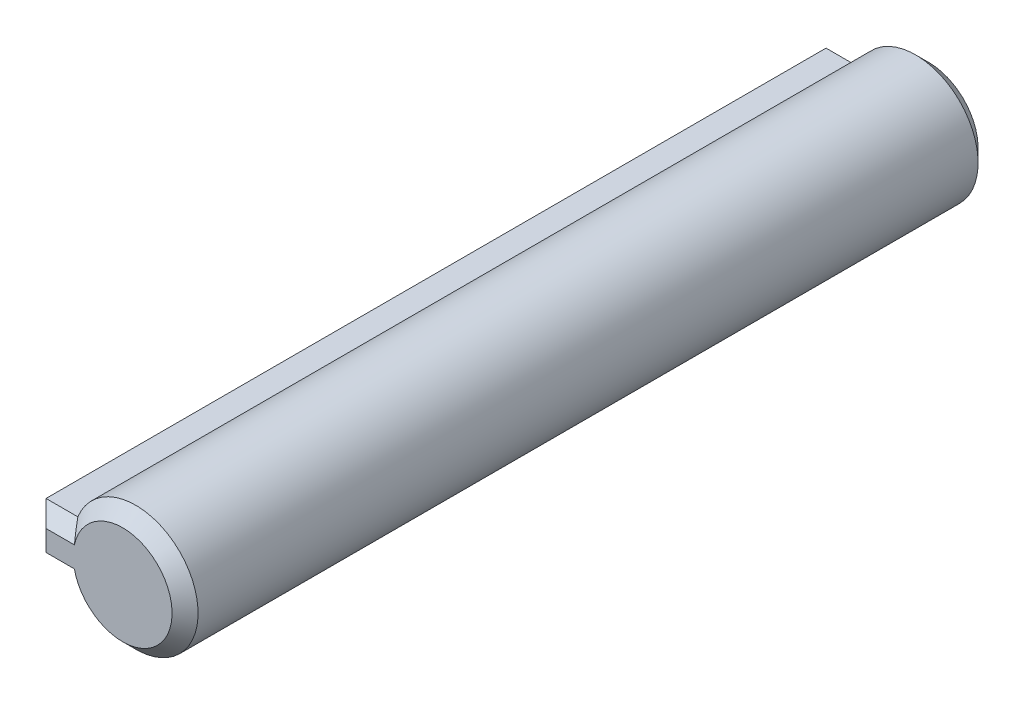
ISO-10303-21;
HEADER;
FILE_DESCRIPTION(('STEP AP214'),'2;1');
FILE_NAME('part.step','',(''),(''),'','','');
FILE_SCHEMA(('AUTOMOTIVE_DESIGN { 1 0 10303 214 1 1 1 1 }'));
ENDSEC;
DATA;
#1=APPLICATION_CONTEXT('core data for automotive mechanical design processes');
#2=APPLICATION_PROTOCOL_DEFINITION('international standard','automotive_design',2000,#1);
#3=PRODUCT_CONTEXT('',#1,'mechanical');
#4=PRODUCT('Part','Part','',(#3));
#5=PRODUCT_RELATED_PRODUCT_CATEGORY('part','',(#4));
#6=PRODUCT_DEFINITION_FORMATION('','',#4);
#7=PRODUCT_DEFINITION_CONTEXT('part definition',#1,'design');
#8=PRODUCT_DEFINITION('design','',#6,#7);
#9=PRODUCT_DEFINITION_SHAPE('','',#8);
#10=(LENGTH_UNIT() NAMED_UNIT(*) SI_UNIT(.MILLI.,.METRE.));
#11=(NAMED_UNIT(*) PLANE_ANGLE_UNIT() SI_UNIT($,.RADIAN.));
#12=(NAMED_UNIT(*) SI_UNIT($,.STERADIAN.) SOLID_ANGLE_UNIT());
#13=UNCERTAINTY_MEASURE_WITH_UNIT(LENGTH_MEASURE(1.E-05),#10,'distance_accuracy_value','');
#14=(GEOMETRIC_REPRESENTATION_CONTEXT(3) GLOBAL_UNCERTAINTY_ASSIGNED_CONTEXT((#13)) GLOBAL_UNIT_ASSIGNED_CONTEXT((#10,
#11,#12)) REPRESENTATION_CONTEXT('',''));
#15=CARTESIAN_POINT('',(0.,0.,0.));
#16=DIRECTION('',(0.,0.,1.));
#17=DIRECTION('',(1.,0.,0.));
#18=AXIS2_PLACEMENT_3D('',#15,#16,#17);
#19=CARTESIAN_POINT('',(-0.207098277141903,-1.1475,50.7625));
#20=DIRECTION('',(0.,1.,0.));
#21=DIRECTION('',(0.,0.,1.));
#22=AXIS2_PLACEMENT_3D('',#19,#20,#21);
#23=PLANE('',#22);
#24=DIRECTION('',(0.,0.,-1.));
#25=VECTOR('',#24,1.);
#26=CARTESIAN_POINT('',(-4.60429977375132,-1.1475,50.7625));
#27=LINE('',#26,#25);
#28=CARTESIAN_POINT('',(-4.60429977375132,-1.1475,50.125));
#29=VERTEX_POINT('',#28);
#30=CARTESIAN_POINT('',(-4.60429977375132,-1.1475,11.875));
#31=VERTEX_POINT('',#30);
#32=EDGE_CURVE('E120',#29,#31,#27,.T.);
#33=ORIENTED_EDGE('',*,*,#32,.T.);
#34=DIRECTION('',(1.,0.,0.));
#35=VECTOR('',#34,1.);
#36=CARTESIAN_POINT('',(-0.207098277141903,-1.1475,11.875));
#37=LINE('',#36,#35);
#38=CARTESIAN_POINT('',(-3.04379419845599,-1.1475,11.875));
#39=VERTEX_POINT('',#38);
#40=EDGE_CURVE('E128',#31,#39,#37,.T.);
#41=ORIENTED_EDGE('',*,*,#40,.T.);
#42=DIRECTION('',(0.,0.,-1.));
#43=VECTOR('',#42,1.);
#44=CARTESIAN_POINT('',(-3.04379419845599,-1.1475,50.7625));
#45=LINE('',#44,#43);
#46=CARTESIAN_POINT('',(-3.04379419845599,-1.1475,50.125));
#47=VERTEX_POINT('',#46);
#48=EDGE_CURVE('E122',#47,#39,#45,.T.);
#49=ORIENTED_EDGE('',*,*,#48,.F.);
#50=DIRECTION('',(-1.,0.,0.));
#51=VECTOR('',#50,1.);
#52=CARTESIAN_POINT('',(-4.60429977375132,-1.1475,50.125));
#53=LINE('',#52,#51);
#54=EDGE_CURVE('E117',#47,#29,#53,.T.);
#55=ORIENTED_EDGE('',*,*,#54,.T.);
#56=EDGE_LOOP('',(#33,#41,#49,#55));
#57=FACE_BOUND('',#56,.T.);
#58=ADVANCED_FACE('F48',(#57),#23,.F.);
#59=CARTESIAN_POINT('',(-0.207098277141903,0.,50.7625));
#60=DIRECTION('',(0.,0.,-1.));
#61=DIRECTION('',(-1.,0.,0.));
#62=AXIS2_PLACEMENT_3D('',#59,#60,#61);
#63=CYLINDRICAL_SURFACE('',#62,3.06);
#64=ORIENTED_EDGE('',*,*,#48,.T.);
#65=CARTESIAN_POINT('',(-0.207098277141903,0.,11.875));
#66=DIRECTION('',(0.,0.,1.));
#67=DIRECTION('',(1.,0.,0.));
#68=AXIS2_PLACEMENT_3D('',#65,#66,#67);
#69=CIRCLE('',#68,3.06);
#70=CARTESIAN_POINT('',(-3.04379419845599,1.1475,11.875));
#71=VERTEX_POINT('',#70);
#72=EDGE_CURVE('E12',#39,#71,#69,.T.);
#73=ORIENTED_EDGE('',*,*,#72,.T.);
#74=DIRECTION('',(0.,0.,-1.));
#75=VECTOR('',#74,1.);
#76=CARTESIAN_POINT('',(-3.04379419845599,1.1475,50.7625));
#77=LINE('',#76,#75);
#78=CARTESIAN_POINT('',(-3.04379419845599,1.1475,50.125));
#79=VERTEX_POINT('',#78);
#80=EDGE_CURVE('E162',#79,#71,#77,.T.);
#81=ORIENTED_EDGE('',*,*,#80,.F.);
#82=CARTESIAN_POINT('',(-0.207098277141903,0.,50.125));
#83=DIRECTION('',(0.,0.,1.));
#84=DIRECTION('',(1.,0.,0.));
#85=AXIS2_PLACEMENT_3D('',#82,#83,#84);
#86=CIRCLE('',#85,3.06);
#87=EDGE_CURVE('E129',#79,#47,#86,.F.);
#88=ORIENTED_EDGE('',*,*,#87,.T.);
#89=EDGE_LOOP('',(#64,#73,#81,#88));
#90=FACE_BOUND('',#89,.T.);
#91=ADVANCED_FACE('F244',(#90),#63,.T.);
#92=CARTESIAN_POINT('',(-0.207098277141903,1.1475,50.7625));
#93=DIRECTION('',(0.,1.,0.));
#94=DIRECTION('',(-1.,0.,0.));
#95=AXIS2_PLACEMENT_3D('',#92,#93,#94);
#96=PLANE('',#95);
#97=ORIENTED_EDGE('',*,*,#80,.T.);
#98=DIRECTION('',(-1.,0.,0.));
#99=VECTOR('',#98,1.);
#100=CARTESIAN_POINT('',(-4.60429977375132,1.1475,11.875));
#101=LINE('',#100,#99);
#102=CARTESIAN_POINT('',(-4.60429977375132,1.1475,11.875));
#103=VERTEX_POINT('',#102);
#104=EDGE_CURVE('E58',#71,#103,#101,.T.);
#105=ORIENTED_EDGE('',*,*,#104,.T.);
#106=DIRECTION('',(0.,0.,-1.));
#107=VECTOR('',#106,1.);
#108=CARTESIAN_POINT('',(-4.60429977375132,1.1475,50.7625));
#109=LINE('',#108,#107);
#110=CARTESIAN_POINT('',(-4.60429977375132,1.1475,50.125));
#111=VERTEX_POINT('',#110);
#112=EDGE_CURVE('E139',#111,#103,#109,.T.);
#113=ORIENTED_EDGE('',*,*,#112,.F.);
#114=DIRECTION('',(1.,0.,0.));
#115=VECTOR('',#114,1.);
#116=CARTESIAN_POINT('',(-0.207098277141903,1.1475,50.125));
#117=LINE('',#116,#115);
#118=EDGE_CURVE('E174',#111,#79,#117,.T.);
#119=ORIENTED_EDGE('',*,*,#118,.T.);
#120=EDGE_LOOP('',(#97,#105,#113,#119));
#121=FACE_BOUND('',#120,.T.);
#122=ADVANCED_FACE('F249',(#121),#96,.T.);
#123=CARTESIAN_POINT('',(-4.60429977375132,0.,50.7625));
#124=DIRECTION('',(-1.,0.,0.));
#125=DIRECTION('',(0.,-1.,0.));
#126=AXIS2_PLACEMENT_3D('',#123,#124,#125);
#127=PLANE('',#126);
#128=ORIENTED_EDGE('',*,*,#112,.T.);
#129=DIRECTION('',(0.,-1.,0.));
#130=VECTOR('',#129,1.);
#131=CARTESIAN_POINT('',(-4.60429977375132,-1.1475,11.875));
#132=LINE('',#131,#130);
#133=EDGE_CURVE('E137',#103,#31,#132,.T.);
#134=ORIENTED_EDGE('',*,*,#133,.T.);
#135=ORIENTED_EDGE('',*,*,#32,.F.);
#136=DIRECTION('',(0.,1.,0.));
#137=VECTOR('',#136,1.);
#138=CARTESIAN_POINT('',(-4.60429977375132,0.,50.125));
#139=LINE('',#138,#137);
#140=EDGE_CURVE('E135',#29,#111,#139,.T.);
#141=ORIENTED_EDGE('',*,*,#140,.T.);
#142=EDGE_LOOP('',(#128,#134,#135,#141));
#143=FACE_BOUND('',#142,.T.);
#144=ADVANCED_FACE('F133',(#143),#127,.T.);
#145=CARTESIAN_POINT('',(-0.207098277141903,0.,50.7625));
#146=DIRECTION('',(0.,0.,1.));
#147=DIRECTION('',(1.,0.,0.));
#148=AXIS2_PLACEMENT_3D('',#145,#146,#147);
#149=PLANE('',#148);
#150=DIRECTION('',(-1.,0.,0.));
#151=VECTOR('',#150,1.);
#152=CARTESIAN_POINT('',(-0.207098277141903,0.509999999999999,50.7625));
#153=LINE('',#152,#151);
#154=CARTESIAN_POINT('',(-2.57530566882026,0.509999999999999,50.7625));
#155=VERTEX_POINT('',#154);
#156=CARTESIAN_POINT('',(-3.96679977375132,0.509999999999999,50.7625));
#157=VERTEX_POINT('',#156);
#158=EDGE_CURVE('E168',#155,#157,#153,.T.);
#159=ORIENTED_EDGE('',*,*,#158,.T.);
#160=DIRECTION('',(0.,-1.,0.));
#161=VECTOR('',#160,1.);
#162=CARTESIAN_POINT('',(-3.96679977375132,0.,50.7625));
#163=LINE('',#162,#161);
#164=CARTESIAN_POINT('',(-3.96679977375132,-0.509999999999999,50.7625));
#165=VERTEX_POINT('',#164);
#166=EDGE_CURVE('E171',#157,#165,#163,.T.);
#167=ORIENTED_EDGE('',*,*,#166,.T.);
#168=DIRECTION('',(1.,0.,0.));
#169=VECTOR('',#168,1.);
#170=CARTESIAN_POINT('',(-3.04379419845599,-0.509999999999999,50.7625));
#171=LINE('',#170,#169);
#172=CARTESIAN_POINT('',(-2.57530566882026,-0.509999999999999,50.7625));
#173=VERTEX_POINT('',#172);
#174=EDGE_CURVE('E145',#165,#173,#171,.T.);
#175=ORIENTED_EDGE('',*,*,#174,.T.);
#176=CARTESIAN_POINT('',(-0.207098277141903,0.,50.7625));
#177=DIRECTION('',(0.,0.,1.));
#178=DIRECTION('',(1.,0.,0.));
#179=AXIS2_PLACEMENT_3D('',#176,#177,#178);
#180=CIRCLE('',#179,2.4225);
#181=EDGE_CURVE('E160',#173,#155,#180,.T.);
#182=ORIENTED_EDGE('',*,*,#181,.T.);
#183=EDGE_LOOP('',(#159,#167,#175,#182));
#184=FACE_BOUND('',#183,.T.);
#185=ADVANCED_FACE('F256',(#184),#149,.T.);
#186=CARTESIAN_POINT('',(-0.207098277141903,0.,11.2375));
#187=DIRECTION('',(0.,0.,1.));
#188=DIRECTION('',(1.,0.,0.));
#189=AXIS2_PLACEMENT_3D('',#186,#187,#188);
#190=PLANE('',#189);
#191=CARTESIAN_POINT('',(-0.207098277141903,0.,11.2375));
#192=DIRECTION('',(0.,0.,1.));
#193=DIRECTION('',(1.,0.,0.));
#194=AXIS2_PLACEMENT_3D('',#191,#192,#193);
#195=CIRCLE('',#194,2.42249999999999);
#196=CARTESIAN_POINT('',(-2.57530566882025,0.50999999999999,11.2375));
#197=VERTEX_POINT('',#196);
#198=CARTESIAN_POINT('',(-2.57530566882025,-0.509999999999991,11.2375));
#199=VERTEX_POINT('',#198);
#200=EDGE_CURVE('E282',#197,#199,#195,.F.);
#201=ORIENTED_EDGE('',*,*,#200,.T.);
#202=DIRECTION('',(-1.,0.,0.));
#203=VECTOR('',#202,1.);
#204=CARTESIAN_POINT('',(-0.207098277141903,-0.509999999999991,11.2375));
#205=LINE('',#204,#203);
#206=CARTESIAN_POINT('',(-3.96679977375131,-0.509999999999991,11.2375));
#207=VERTEX_POINT('',#206);
#208=EDGE_CURVE('E286',#199,#207,#205,.T.);
#209=ORIENTED_EDGE('',*,*,#208,.T.);
#210=DIRECTION('',(0.,1.,0.));
#211=VECTOR('',#210,1.);
#212=CARTESIAN_POINT('',(-3.96679977375131,1.1475,11.2375));
#213=LINE('',#212,#211);
#214=CARTESIAN_POINT('',(-3.96679977375131,0.50999999999999,11.2375));
#215=VERTEX_POINT('',#214);
#216=EDGE_CURVE('E276',#207,#215,#213,.T.);
#217=ORIENTED_EDGE('',*,*,#216,.T.);
#218=DIRECTION('',(1.,0.,0.));
#219=VECTOR('',#218,1.);
#220=CARTESIAN_POINT('',(-3.04379419845599,0.50999999999999,11.2375));
#221=LINE('',#220,#219);
#222=EDGE_CURVE('E279',#215,#197,#221,.T.);
#223=ORIENTED_EDGE('',*,*,#222,.T.);
#224=EDGE_LOOP('',(#201,#209,#217,#223));
#225=FACE_BOUND('',#224,.T.);
#226=ADVANCED_FACE('F202',(#225),#190,.F.);
#227=CARTESIAN_POINT('',(-0.207098277141903,0.,50.7625));
#228=DIRECTION('',(0.,0.,-1.));
#229=DIRECTION('',(-1.,0.,0.));
#230=AXIS2_PLACEMENT_3D('',#227,#228,#229);
#231=CONICAL_SURFACE('',#230,2.4225,0.785398163397445);
#232=CARTESIAN_POINT('',(-3.04379419845599,1.1475,50.125));
#233=CARTESIAN_POINT('',(-3.00734371935754,1.09344080640847,50.1790591935915));
#234=CARTESIAN_POINT('',(-2.97032600349586,1.03957105127789,50.2329289487221));
#235=CARTESIAN_POINT('',(-2.89505018472373,0.932289655226335,50.3402103447737));
#236=CARTESIAN_POINT('',(-2.85679250590517,0.878877865413127,50.3936221345869));
#237=CARTESIAN_POINT('',(-2.77890256116624,0.772549810243668,50.4999501897563));
#238=CARTESIAN_POINT('',(-2.73927016249076,0.719633593374491,50.5528664066255));
#239=CARTESIAN_POINT('',(-2.65847223738681,0.614366955710419,50.6581330442896));
#240=CARTESIAN_POINT('',(-2.6173061958076,0.562016732791605,50.7104832672084));
#241=CARTESIAN_POINT('',(-2.57530566882026,0.509999999999998,50.7625));
#242=B_SPLINE_CURVE_WITH_KNOTS('',3,(#232,#233,#234,#235,#236,#237,#238,#239,#240,#241),
.UNSPECIFIED.,.F.,.F.,(4,2,2,2,4),(0.,0.254089259731815,0.508092514407951,0.762120366553572,
1.01623432993078),.UNSPECIFIED.);
#243=EDGE_CURVE('E150',#155,#79,#242,.F.);
#244=ORIENTED_EDGE('',*,*,#243,.F.);
#245=ORIENTED_EDGE('',*,*,#181,.F.);
#246=CARTESIAN_POINT('',(-3.04379419845599,-1.1475,50.125));
#247=CARTESIAN_POINT('',(-3.00734371935754,-1.09344080640847,50.1790591935915));
#248=CARTESIAN_POINT('',(-2.97032600349586,-1.03957105127788,50.2329289487221));
#249=CARTESIAN_POINT('',(-2.89505018472374,-0.932289655226329,50.3402103447737));
#250=CARTESIAN_POINT('',(-2.85679250590517,-0.878877865413123,50.3936221345869));
#251=CARTESIAN_POINT('',(-2.77890256116624,-0.772549810243664,50.4999501897563));
#252=CARTESIAN_POINT('',(-2.73927016249076,-0.719633593374486,50.5528664066255));
#253=CARTESIAN_POINT('',(-2.65847223738681,-0.614366955710412,50.6581330442896));
#254=CARTESIAN_POINT('',(-2.6173061958076,-0.562016732791599,50.7104832672084));
#255=CARTESIAN_POINT('',(-2.57530566882026,-0.509999999999998,50.7625));
#256=B_SPLINE_CURVE_WITH_KNOTS('',3,(#246,#247,#248,#249,#250,#251,#252,#253,#254,#255),
.UNSPECIFIED.,.F.,.F.,(4,2,2,2,4),(0.,0.254089259731813,0.508092514407953,0.76212036655357,
1.01623432993078),.UNSPECIFIED.);
#257=EDGE_CURVE('E140',#47,#173,#256,.T.);
#258=ORIENTED_EDGE('',*,*,#257,.F.);
#259=ORIENTED_EDGE('',*,*,#87,.F.);
#260=EDGE_LOOP('',(#244,#245,#258,#259));
#261=FACE_BOUND('',#260,.T.);
#262=ADVANCED_FACE('F199',(#261),#231,.T.);
#263=CARTESIAN_POINT('',(-0.207098277141903,-0.509999999999999,50.7625));
#264=DIRECTION('',(0.,-0.70710678118655,0.707106781186545));
#265=DIRECTION('',(-1.,0.,0.));
#266=AXIS2_PLACEMENT_3D('',#263,#264,#265);
#267=PLANE('',#266);
#268=ORIENTED_EDGE('',*,*,#257,.T.);
#269=ORIENTED_EDGE('',*,*,#174,.F.);
#270=DIRECTION('',(0.577350269189625,0.577350269189624,0.577350269189628));
#271=VECTOR('',#270,1.);
#272=CARTESIAN_POINT('',(-2.71356594154818,0.743233832203133,52.0157338322031));
#273=LINE('',#272,#271);
#274=EDGE_CURVE('E143',#29,#165,#273,.T.);
#275=ORIENTED_EDGE('',*,*,#274,.F.);
#276=ORIENTED_EDGE('',*,*,#54,.F.);
#277=EDGE_LOOP('',(#268,#269,#275,#276));
#278=FACE_BOUND('',#277,.T.);
#279=ADVANCED_FACE('F144',(#278),#267,.T.);
#280=CARTESIAN_POINT('',(-0.207098277141903,1.1475,50.125));
#281=DIRECTION('',(0.,-0.70710678118655,-0.707106781186545));
#282=DIRECTION('',(1.,0.,0.));
#283=AXIS2_PLACEMENT_3D('',#280,#281,#282);
#284=PLANE('',#283);
#285=ORIENTED_EDGE('',*,*,#243,.T.);
#286=ORIENTED_EDGE('',*,*,#118,.F.);
#287=DIRECTION('',(0.577350269189624,-0.577350269189625,0.577350269189629));
#288=VECTOR('',#287,1.);
#289=CARTESIAN_POINT('',(-3.13856594154819,-0.318233832203131,51.5907338322031));
#290=LINE('',#289,#288);
#291=EDGE_CURVE('E151',#157,#111,#290,.F.);
#292=ORIENTED_EDGE('',*,*,#291,.F.);
#293=ORIENTED_EDGE('',*,*,#158,.F.);
#294=EDGE_LOOP('',(#285,#286,#292,#293));
#295=FACE_BOUND('',#294,.T.);
#296=ADVANCED_FACE('F196',(#295),#284,.F.);
#297=CARTESIAN_POINT('',(-4.60429977375132,0.,50.125));
#298=DIRECTION('',(0.70710678118655,0.,-0.707106781186545));
#299=DIRECTION('',(0.,1.,0.));
#300=AXIS2_PLACEMENT_3D('',#297,#298,#299);
#301=PLANE('',#300);
#302=ORIENTED_EDGE('',*,*,#274,.T.);
#303=ORIENTED_EDGE('',*,*,#166,.F.);
#304=ORIENTED_EDGE('',*,*,#291,.T.);
#305=ORIENTED_EDGE('',*,*,#140,.F.);
#306=EDGE_LOOP('',(#302,#303,#304,#305));
#307=FACE_BOUND('',#306,.T.);
#308=ADVANCED_FACE('F153',(#307),#301,.F.);
#309=CARTESIAN_POINT('',(-0.207098277141903,0.50999999999999,11.2375));
#310=DIRECTION('',(0.,0.707106781186545,-0.70710678118655));
#311=DIRECTION('',(-1.,0.,0.));
#312=AXIS2_PLACEMENT_3D('',#309,#310,#311);
#313=PLANE('',#312);
#314=CARTESIAN_POINT('',(-2.57530566882025,0.50999999999999,11.2375));
#315=CARTESIAN_POINT('',(-2.6173061958076,0.562016732791592,11.2895167327916));
#316=CARTESIAN_POINT('',(-2.65847223738681,0.614366955710405,11.3418669557104));
#317=CARTESIAN_POINT('',(-2.73927016249076,0.719633593374479,11.4471335933745));
#318=CARTESIAN_POINT('',(-2.77890256116624,0.772549810243659,11.5000498102437));
#319=CARTESIAN_POINT('',(-2.85679250590517,0.87887786541312,11.6063778654131));
#320=CARTESIAN_POINT('',(-2.89505018472374,0.932289655226327,11.6597896552263));
#321=CARTESIAN_POINT('',(-2.97032600349586,1.03957105127788,11.7670710512779));
#322=CARTESIAN_POINT('',(-3.00734371935755,1.09344080640847,11.8209408064085));
#323=CARTESIAN_POINT('',(-3.04379419845599,1.1475,11.875));
#324=B_SPLINE_CURVE_WITH_KNOTS('',3,(#314,#315,#316,#317,#318,#319,#320,#321,#322,#323),
.UNSPECIFIED.,.F.,.F.,(4,2,2,2,4),(0.,0.254113963377207,0.508141815522832,0.762145070198974,
1.01623432993079),.UNSPECIFIED.);
#325=EDGE_CURVE('E226',#197,#71,#324,.T.);
#326=ORIENTED_EDGE('',*,*,#325,.F.);
#327=ORIENTED_EDGE('',*,*,#222,.F.);
#328=DIRECTION('',(-0.577350269189627,0.577350269189627,0.577350269189623));
#329=VECTOR('',#328,1.);
#330=CARTESIAN_POINT('',(-2.71356594154817,-0.743233832203151,9.98426616779687));
#331=LINE('',#330,#329);
#332=EDGE_CURVE('E52',#103,#215,#331,.F.);
#333=ORIENTED_EDGE('',*,*,#332,.F.);
#334=ORIENTED_EDGE('',*,*,#104,.F.);
#335=EDGE_LOOP('',(#326,#327,#333,#334));
#336=FACE_BOUND('',#335,.T.);
#337=ADVANCED_FACE('F233',(#336),#313,.T.);
#338=CARTESIAN_POINT('',(-3.96679977375131,0.,11.2375));
#339=DIRECTION('',(-0.707106781186545,0.,-0.70710678118655));
#340=DIRECTION('',(0.,-1.,0.));
#341=AXIS2_PLACEMENT_3D('',#338,#339,#340);
#342=PLANE('',#341);
#343=ORIENTED_EDGE('',*,*,#332,.T.);
#344=ORIENTED_EDGE('',*,*,#216,.F.);
#345=DIRECTION('',(0.577350269189627,0.577350269189627,-0.577350269189623));
#346=VECTOR('',#345,1.);
#347=CARTESIAN_POINT('',(-3.79679977375131,-0.339999999999993,11.0675));
#348=LINE('',#347,#346);
#349=EDGE_CURVE('E223',#31,#207,#348,.T.);
#350=ORIENTED_EDGE('',*,*,#349,.F.);
#351=ORIENTED_EDGE('',*,*,#133,.F.);
#352=EDGE_LOOP('',(#343,#344,#350,#351));
#353=FACE_BOUND('',#352,.T.);
#354=ADVANCED_FACE('F50',(#353),#342,.T.);
#355=CARTESIAN_POINT('',(-0.207098277141903,0.,11.875));
#356=DIRECTION('',(0.,0.,1.));
#357=DIRECTION('',(1.,0.,0.));
#358=AXIS2_PLACEMENT_3D('',#355,#356,#357);
#359=CONICAL_SURFACE('',#358,3.06,0.785398163397452);
#360=ORIENTED_EDGE('',*,*,#325,.T.);
#361=ORIENTED_EDGE('',*,*,#72,.F.);
#362=CARTESIAN_POINT('',(-3.04379419845599,-1.1475,11.875));
#363=CARTESIAN_POINT('',(-3.00734371935754,-1.09344080640847,11.8209408064085));
#364=CARTESIAN_POINT('',(-2.97032600349586,-1.03957105127788,11.7670710512779));
#365=CARTESIAN_POINT('',(-2.89505018472374,-0.932289655226328,11.6597896552263));
#366=CARTESIAN_POINT('',(-2.85679250590517,-0.878877865413121,11.6063778654131));
#367=CARTESIAN_POINT('',(-2.77890256116624,-0.772549810243659,11.5000498102437));
#368=CARTESIAN_POINT('',(-2.73927016249076,-0.71963359337448,11.4471335933745));
#369=CARTESIAN_POINT('',(-2.65847223738681,-0.614366955710406,11.3418669557104));
#370=CARTESIAN_POINT('',(-2.6173061958076,-0.562016732791593,11.2895167327916));
#371=CARTESIAN_POINT('',(-2.57530566882025,-0.509999999999991,11.2375));
#372=B_SPLINE_CURVE_WITH_KNOTS('',3,(#362,#363,#364,#365,#366,#367,#368,#369,#370,#371),
.UNSPECIFIED.,.F.,.F.,(4,2,2,2,4),(0.,0.254089259731818,0.508092514407959,0.762120366553584,
1.01623432993079),.UNSPECIFIED.);
#373=EDGE_CURVE('E216',#199,#39,#372,.F.);
#374=ORIENTED_EDGE('',*,*,#373,.F.);
#375=ORIENTED_EDGE('',*,*,#200,.F.);
#376=EDGE_LOOP('',(#360,#361,#374,#375));
#377=FACE_BOUND('',#376,.T.);
#378=ADVANCED_FACE('F212',(#377),#359,.T.);
#379=CARTESIAN_POINT('',(-0.207098277141903,-1.1475,11.875));
#380=DIRECTION('',(0.,0.707106781186545,0.70710678118655));
#381=DIRECTION('',(1.,0.,0.));
#382=AXIS2_PLACEMENT_3D('',#379,#380,#381);
#383=PLANE('',#382);
#384=ORIENTED_EDGE('',*,*,#349,.T.);
#385=ORIENTED_EDGE('',*,*,#208,.F.);
#386=ORIENTED_EDGE('',*,*,#373,.T.);
#387=ORIENTED_EDGE('',*,*,#40,.F.);
#388=EDGE_LOOP('',(#384,#385,#386,#387));
#389=FACE_BOUND('',#388,.T.);
#390=ADVANCED_FACE('F208',(#389),#383,.F.);
#391=CLOSED_SHELL('',(#58,#91,#122,#144,#185,#226,#262,#279,#296,#308,#337,#354,#378,#390));
#392=MANIFOLD_SOLID_BREP('B2',#391);
#393=ADVANCED_BREP_SHAPE_REPRESENTATION('',(#18,#392),#14);
#394=SHAPE_DEFINITION_REPRESENTATION(#9,#393);
ENDSEC;
END-ISO-10303-21;
